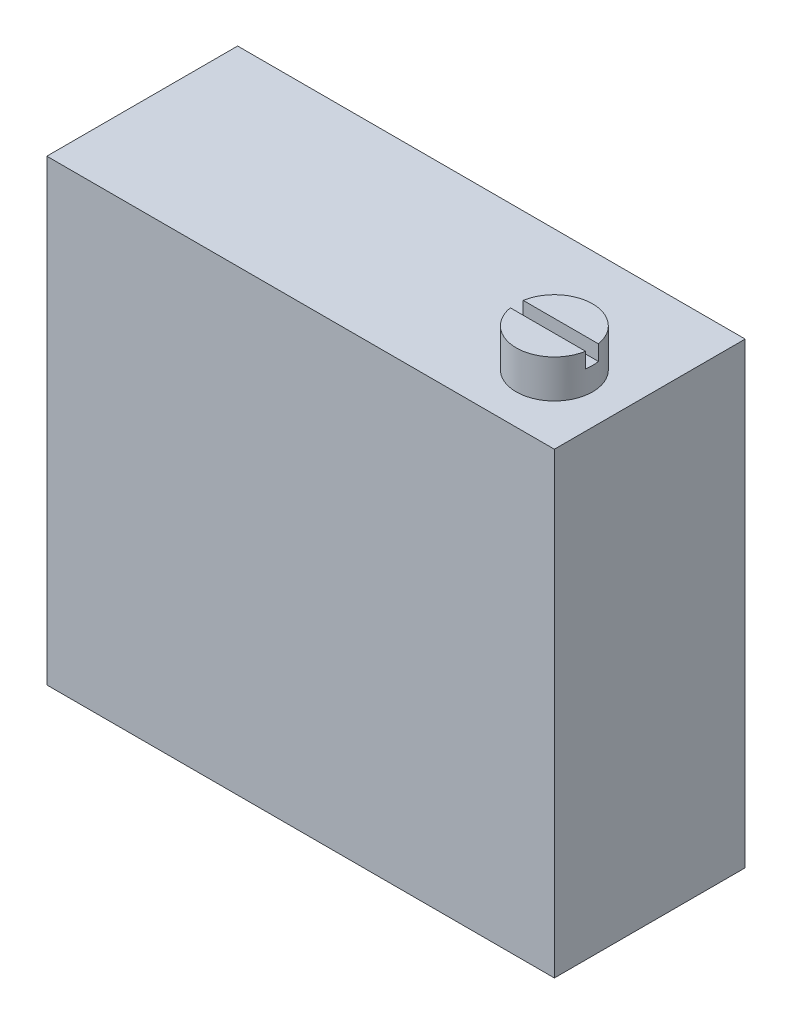
ISO-10303-21;
HEADER;
FILE_DESCRIPTION(('STEP AP214'),'2;1');
FILE_NAME('part.step','',(''),(''),'','','');
FILE_SCHEMA(('AUTOMOTIVE_DESIGN { 1 0 10303 214 1 1 1 1 }'));
ENDSEC;
DATA;
#1=APPLICATION_CONTEXT('core data for automotive mechanical design processes');
#2=APPLICATION_PROTOCOL_DEFINITION('international standard','automotive_design',2000,#1);
#3=PRODUCT_CONTEXT('',#1,'mechanical');
#4=PRODUCT('Part','Part','',(#3));
#5=PRODUCT_RELATED_PRODUCT_CATEGORY('part','',(#4));
#6=PRODUCT_DEFINITION_FORMATION('','',#4);
#7=PRODUCT_DEFINITION_CONTEXT('part definition',#1,'design');
#8=PRODUCT_DEFINITION('design','',#6,#7);
#9=PRODUCT_DEFINITION_SHAPE('','',#8);
#10=(LENGTH_UNIT() NAMED_UNIT(*) SI_UNIT(.MILLI.,.METRE.));
#11=(NAMED_UNIT(*) PLANE_ANGLE_UNIT() SI_UNIT($,.RADIAN.));
#12=(NAMED_UNIT(*) SI_UNIT($,.STERADIAN.) SOLID_ANGLE_UNIT());
#13=UNCERTAINTY_MEASURE_WITH_UNIT(LENGTH_MEASURE(1.E-05),#10,'distance_accuracy_value','');
#14=(GEOMETRIC_REPRESENTATION_CONTEXT(3) GLOBAL_UNCERTAINTY_ASSIGNED_CONTEXT((#13)) GLOBAL_UNIT_ASSIGNED_CONTEXT((#10,
#11,#12)) REPRESENTATION_CONTEXT('',''));
#15=CARTESIAN_POINT('',(0.,0.,0.));
#16=DIRECTION('',(0.,0.,1.));
#17=DIRECTION('',(1.,0.,0.));
#18=AXIS2_PLACEMENT_3D('',#15,#16,#17);
#19=CARTESIAN_POINT('',(-33.4993079584775,13.,19.2264623496457));
#20=DIRECTION('',(0.,1.,0.));
#21=DIRECTION('',(0.,0.,1.));
#22=AXIS2_PLACEMENT_3D('',#19,#20,#21);
#23=PLANE('',#22);
#24=DIRECTION('',(1.,0.,0.));
#25=VECTOR('',#24,1.);
#26=CARTESIAN_POINT('',(-33.4993079584775,13.,19.3951981505615));
#27=LINE('',#26,#25);
#28=CARTESIAN_POINT('',(-34.48496927429,13.,19.3951981505615));
#29=VERTEX_POINT('',#28);
#30=CARTESIAN_POINT('',(-32.513646642665,13.,19.3951981505615));
#31=VERTEX_POINT('',#30);
#32=EDGE_CURVE('E128',#29,#31,#27,.T.);
#33=ORIENTED_EDGE('',*,*,#32,.F.);
#34=CARTESIAN_POINT('',(-33.4993079584775,13.,19.2264623496457));
#35=DIRECTION('',(0.,1.,0.));
#36=DIRECTION('',(0.,0.,1.));
#37=AXIS2_PLACEMENT_3D('',#34,#35,#36);
#38=CIRCLE('',#37,0.999999999999998);
#39=EDGE_CURVE('E143',#29,#31,#38,.T.);
#40=ORIENTED_EDGE('',*,*,#39,.T.);
#41=EDGE_LOOP('',(#33,#40));
#42=FACE_BOUND('',#41,.T.);
#43=ADVANCED_FACE('F45',(#42),#23,.T.);
#44=CARTESIAN_POINT('',(-44.9993079584775,12.,16.0264623496457));
#45=DIRECTION('',(1.,0.,0.));
#46=DIRECTION('',(0.,0.,-1.));
#47=AXIS2_PLACEMENT_3D('',#44,#45,#46);
#48=PLANE('',#47);
#49=DIRECTION('',(0.,0.,1.));
#50=VECTOR('',#49,1.);
#51=CARTESIAN_POINT('',(-44.9993079584775,0.,16.0264623496457));
#52=LINE('',#51,#50);
#53=CARTESIAN_POINT('',(-44.9993079584775,0.,16.0264623496457));
#54=VERTEX_POINT('',#53);
#55=CARTESIAN_POINT('',(-44.9993079584775,0.,21.0264623496457));
#56=VERTEX_POINT('',#55);
#57=EDGE_CURVE('E142',#54,#56,#52,.T.);
#58=ORIENTED_EDGE('',*,*,#57,.T.);
#59=DIRECTION('',(0.,-1.,0.));
#60=VECTOR('',#59,1.);
#61=CARTESIAN_POINT('',(-44.9993079584775,12.,21.0264623496457));
#62=LINE('',#61,#60);
#63=CARTESIAN_POINT('',(-44.9993079584775,12.,21.0264623496457));
#64=VERTEX_POINT('',#63);
#65=EDGE_CURVE('E129',#64,#56,#62,.T.);
#66=ORIENTED_EDGE('',*,*,#65,.F.);
#67=DIRECTION('',(0.,0.,1.));
#68=VECTOR('',#67,1.);
#69=CARTESIAN_POINT('',(-44.9993079584775,12.,16.0264623496457));
#70=LINE('',#69,#68);
#71=CARTESIAN_POINT('',(-44.9993079584775,12.,16.0264623496457));
#72=VERTEX_POINT('',#71);
#73=EDGE_CURVE('E159',#72,#64,#70,.T.);
#74=ORIENTED_EDGE('',*,*,#73,.F.);
#75=DIRECTION('',(0.,-1.,0.));
#76=VECTOR('',#75,1.);
#77=CARTESIAN_POINT('',(-44.9993079584775,12.,16.0264623496457));
#78=LINE('',#77,#76);
#79=EDGE_CURVE('E168',#72,#54,#78,.T.);
#80=ORIENTED_EDGE('',*,*,#79,.T.);
#81=EDGE_LOOP('',(#58,#66,#74,#80));
#82=FACE_BOUND('',#81,.T.);
#83=ADVANCED_FACE('F47',(#82),#48,.F.);
#84=CARTESIAN_POINT('',(-44.9993079584775,12.,21.0264623496457));
#85=DIRECTION('',(0.,0.,-1.));
#86=DIRECTION('',(-1.,0.,0.));
#87=AXIS2_PLACEMENT_3D('',#84,#85,#86);
#88=PLANE('',#87);
#89=DIRECTION('',(1.,0.,0.));
#90=VECTOR('',#89,1.);
#91=CARTESIAN_POINT('',(-44.9993079584775,0.,21.0264623496457));
#92=LINE('',#91,#90);
#93=CARTESIAN_POINT('',(-31.6993079584775,0.,21.0264623496457));
#94=VERTEX_POINT('',#93);
#95=EDGE_CURVE('E148',#56,#94,#92,.T.);
#96=ORIENTED_EDGE('',*,*,#95,.T.);
#97=DIRECTION('',(0.,-1.,0.));
#98=VECTOR('',#97,1.);
#99=CARTESIAN_POINT('',(-31.6993079584775,12.,21.0264623496457));
#100=LINE('',#99,#98);
#101=CARTESIAN_POINT('',(-31.6993079584775,12.,21.0264623496457));
#102=VERTEX_POINT('',#101);
#103=EDGE_CURVE('E182',#102,#94,#100,.T.);
#104=ORIENTED_EDGE('',*,*,#103,.F.);
#105=DIRECTION('',(1.,0.,0.));
#106=VECTOR('',#105,1.);
#107=CARTESIAN_POINT('',(-44.9993079584775,12.,21.0264623496457));
#108=LINE('',#107,#106);
#109=EDGE_CURVE('E99',#64,#102,#108,.T.);
#110=ORIENTED_EDGE('',*,*,#109,.F.);
#111=ORIENTED_EDGE('',*,*,#65,.T.);
#112=EDGE_LOOP('',(#96,#104,#110,#111));
#113=FACE_BOUND('',#112,.T.);
#114=ADVANCED_FACE('F204',(#113),#88,.F.);
#115=CARTESIAN_POINT('',(-31.6993079584775,12.,16.0264623496457));
#116=DIRECTION('',(-1.,0.,0.));
#117=DIRECTION('',(0.,0.,1.));
#118=AXIS2_PLACEMENT_3D('',#115,#116,#117);
#119=PLANE('',#118);
#120=DIRECTION('',(0.,0.,-1.));
#121=VECTOR('',#120,1.);
#122=CARTESIAN_POINT('',(-31.6993079584775,0.,16.0264623496457));
#123=LINE('',#122,#121);
#124=CARTESIAN_POINT('',(-31.6993079584775,0.,16.0264623496457));
#125=VERTEX_POINT('',#124);
#126=EDGE_CURVE('E172',#94,#125,#123,.T.);
#127=ORIENTED_EDGE('',*,*,#126,.T.);
#128=DIRECTION('',(0.,-1.,0.));
#129=VECTOR('',#128,1.);
#130=CARTESIAN_POINT('',(-31.6993079584775,12.,16.0264623496457));
#131=LINE('',#130,#129);
#132=CARTESIAN_POINT('',(-31.6993079584775,12.,16.0264623496457));
#133=VERTEX_POINT('',#132);
#134=EDGE_CURVE('E179',#133,#125,#131,.T.);
#135=ORIENTED_EDGE('',*,*,#134,.F.);
#136=DIRECTION('',(0.,0.,-1.));
#137=VECTOR('',#136,1.);
#138=CARTESIAN_POINT('',(-31.6993079584775,12.,16.0264623496457));
#139=LINE('',#138,#137);
#140=EDGE_CURVE('E164',#102,#133,#139,.T.);
#141=ORIENTED_EDGE('',*,*,#140,.F.);
#142=ORIENTED_EDGE('',*,*,#103,.T.);
#143=EDGE_LOOP('',(#127,#135,#141,#142));
#144=FACE_BOUND('',#143,.T.);
#145=ADVANCED_FACE('F230',(#144),#119,.F.);
#146=CARTESIAN_POINT('',(-44.9993079584775,12.,16.0264623496457));
#147=DIRECTION('',(0.,0.,1.));
#148=DIRECTION('',(1.,0.,0.));
#149=AXIS2_PLACEMENT_3D('',#146,#147,#148);
#150=PLANE('',#149);
#151=DIRECTION('',(-1.,0.,0.));
#152=VECTOR('',#151,1.);
#153=CARTESIAN_POINT('',(-44.9993079584775,0.,16.0264623496457));
#154=LINE('',#153,#152);
#155=EDGE_CURVE('E91',#125,#54,#154,.T.);
#156=ORIENTED_EDGE('',*,*,#155,.T.);
#157=ORIENTED_EDGE('',*,*,#79,.F.);
#158=DIRECTION('',(-1.,0.,0.));
#159=VECTOR('',#158,1.);
#160=CARTESIAN_POINT('',(-44.9993079584775,12.,16.0264623496457));
#161=LINE('',#160,#159);
#162=EDGE_CURVE('E70',#133,#72,#161,.T.);
#163=ORIENTED_EDGE('',*,*,#162,.F.);
#164=ORIENTED_EDGE('',*,*,#134,.T.);
#165=EDGE_LOOP('',(#156,#157,#163,#164));
#166=FACE_BOUND('',#165,.T.);
#167=ADVANCED_FACE('F225',(#166),#150,.F.);
#168=CARTESIAN_POINT('',(0.,12.,0.));
#169=DIRECTION('',(0.,1.,0.));
#170=DIRECTION('',(0.,0.,1.));
#171=AXIS2_PLACEMENT_3D('',#168,#169,#170);
#172=PLANE('',#171);
#173=CARTESIAN_POINT('',(-33.4993079584775,12.,19.2264623496457));
#174=DIRECTION('',(0.,1.,0.));
#175=DIRECTION('',(0.,0.,1.));
#176=AXIS2_PLACEMENT_3D('',#173,#174,#175);
#177=CIRCLE('',#176,0.999999999999998);
#178=CARTESIAN_POINT('',(-33.4993079584775,12.,20.2264623496457));
#179=VERTEX_POINT('',#178);
#180=EDGE_CURVE('E151',#179,#179,#177,.T.);
#181=ORIENTED_EDGE('',*,*,#180,.F.);
#182=EDGE_LOOP('',(#181));
#183=FACE_BOUND('',#182,.T.);
#184=ORIENTED_EDGE('',*,*,#73,.T.);
#185=ORIENTED_EDGE('',*,*,#109,.T.);
#186=ORIENTED_EDGE('',*,*,#140,.T.);
#187=ORIENTED_EDGE('',*,*,#162,.T.);
#188=EDGE_LOOP('',(#184,#185,#186,#187));
#189=FACE_BOUND('',#188,.T.);
#190=ADVANCED_FACE('F220',(#183,#189),#172,.T.);
#191=CARTESIAN_POINT('',(0.,0.,0.));
#192=DIRECTION('',(0.,1.,0.));
#193=DIRECTION('',(0.,0.,1.));
#194=AXIS2_PLACEMENT_3D('',#191,#192,#193);
#195=PLANE('',#194);
#196=ORIENTED_EDGE('',*,*,#57,.F.);
#197=ORIENTED_EDGE('',*,*,#155,.F.);
#198=ORIENTED_EDGE('',*,*,#126,.F.);
#199=ORIENTED_EDGE('',*,*,#95,.F.);
#200=EDGE_LOOP('',(#196,#197,#198,#199));
#201=FACE_BOUND('',#200,.T.);
#202=ADVANCED_FACE('F216',(#201),#195,.F.);
#203=CARTESIAN_POINT('',(-33.4993079584775,13.,19.2264623496457));
#204=DIRECTION('',(0.,-1.,0.));
#205=DIRECTION('',(0.,0.,-1.));
#206=AXIS2_PLACEMENT_3D('',#203,#204,#205);
#207=CYLINDRICAL_SURFACE('',#206,0.999999999999998);
#208=CARTESIAN_POINT('',(-33.4993079584775,12.6,19.2264623496457));
#209=DIRECTION('',(0.,-1.,0.));
#210=DIRECTION('',(0.,0.,-1.));
#211=AXIS2_PLACEMENT_3D('',#208,#209,#210);
#212=CIRCLE('',#211,0.999999999999998);
#213=CARTESIAN_POINT('',(-32.513646642665,12.6,19.05772654873));
#214=VERTEX_POINT('',#213);
#215=CARTESIAN_POINT('',(-32.513646642665,12.6,19.3951981505615));
#216=VERTEX_POINT('',#215);
#217=EDGE_CURVE('E11',#214,#216,#212,.T.);
#218=ORIENTED_EDGE('',*,*,#217,.T.);
#219=DIRECTION('',(0.,-1.,0.));
#220=VECTOR('',#219,1.);
#221=CARTESIAN_POINT('',(-32.513646642665,13.,19.3951981505615));
#222=LINE('',#221,#220);
#223=EDGE_CURVE('E194',#216,#31,#222,.F.);
#224=ORIENTED_EDGE('',*,*,#223,.T.);
#225=ORIENTED_EDGE('',*,*,#39,.F.);
#226=DIRECTION('',(0.,-1.,0.));
#227=VECTOR('',#226,1.);
#228=CARTESIAN_POINT('',(-34.48496927429,13.,19.3951981505615));
#229=LINE('',#228,#227);
#230=CARTESIAN_POINT('',(-34.48496927429,12.6,19.3951981505615));
#231=VERTEX_POINT('',#230);
#232=EDGE_CURVE('E154',#29,#231,#229,.T.);
#233=ORIENTED_EDGE('',*,*,#232,.T.);
#234=CARTESIAN_POINT('',(-34.48496927429,12.6,19.05772654873));
#235=VERTEX_POINT('',#234);
#236=EDGE_CURVE('E49',#231,#235,#212,.T.);
#237=ORIENTED_EDGE('',*,*,#236,.T.);
#238=DIRECTION('',(0.,-1.,0.));
#239=VECTOR('',#238,1.);
#240=CARTESIAN_POINT('',(-34.48496927429,13.,19.05772654873));
#241=LINE('',#240,#239);
#242=CARTESIAN_POINT('',(-34.48496927429,13.,19.05772654873));
#243=VERTEX_POINT('',#242);
#244=EDGE_CURVE('E122',#235,#243,#241,.F.);
#245=ORIENTED_EDGE('',*,*,#244,.T.);
#246=CARTESIAN_POINT('',(-32.513646642665,13.,19.05772654873));
#247=VERTEX_POINT('',#246);
#248=EDGE_CURVE('E135',#247,#243,#38,.T.);
#249=ORIENTED_EDGE('',*,*,#248,.F.);
#250=DIRECTION('',(0.,-1.,0.));
#251=VECTOR('',#250,1.);
#252=CARTESIAN_POINT('',(-32.513646642665,13.,19.05772654873));
#253=LINE('',#252,#251);
#254=EDGE_CURVE('E61',#247,#214,#253,.T.);
#255=ORIENTED_EDGE('',*,*,#254,.T.);
#256=EDGE_LOOP('',(#218,#224,#225,#233,#237,#245,#249,#255));
#257=FACE_BOUND('',#256,.T.);
#258=ORIENTED_EDGE('',*,*,#180,.T.);
#259=EDGE_LOOP('',(#258));
#260=FACE_BOUND('',#259,.T.);
#261=ADVANCED_FACE('F133',(#257,#260),#207,.T.);
#262=DIRECTION('',(-1.,0.,0.));
#263=VECTOR('',#262,1.);
#264=CARTESIAN_POINT('',(-33.4993079584775,13.,19.05772654873));
#265=LINE('',#264,#263);
#266=EDGE_CURVE('E119',#247,#243,#265,.T.);
#267=ORIENTED_EDGE('',*,*,#266,.F.);
#268=ORIENTED_EDGE('',*,*,#248,.T.);
#269=EDGE_LOOP('',(#267,#268));
#270=FACE_BOUND('',#269,.T.);
#271=ADVANCED_FACE('F140',(#270),#23,.T.);
#272=CARTESIAN_POINT('',(0.,12.6,0.));
#273=DIRECTION('',(0.,-1.,0.));
#274=DIRECTION('',(0.,0.,-1.));
#275=AXIS2_PLACEMENT_3D('',#272,#273,#274);
#276=PLANE('',#275);
#277=DIRECTION('',(-1.,0.,0.));
#278=VECTOR('',#277,1.);
#279=CARTESIAN_POINT('',(-34.8686408490907,12.6,19.05772654873));
#280=LINE('',#279,#278);
#281=EDGE_CURVE('E346',#214,#235,#280,.T.);
#282=ORIENTED_EDGE('',*,*,#281,.T.);
#283=ORIENTED_EDGE('',*,*,#236,.F.);
#284=DIRECTION('',(1.,0.,0.));
#285=VECTOR('',#284,1.);
#286=CARTESIAN_POINT('',(-34.8686408490907,12.6,19.3951981505615));
#287=LINE('',#286,#285);
#288=EDGE_CURVE('E138',#231,#216,#287,.T.);
#289=ORIENTED_EDGE('',*,*,#288,.T.);
#290=ORIENTED_EDGE('',*,*,#217,.F.);
#291=EDGE_LOOP('',(#282,#283,#289,#290));
#292=FACE_BOUND('',#291,.T.);
#293=ADVANCED_FACE('F209',(#292),#276,.F.);
#294=CARTESIAN_POINT('',(-34.8686408490907,12.6,19.3951981505615));
#295=DIRECTION('',(0.,0.,1.));
#296=DIRECTION('',(1.,0.,0.));
#297=AXIS2_PLACEMENT_3D('',#294,#295,#296);
#298=PLANE('',#297);
#299=ORIENTED_EDGE('',*,*,#32,.T.);
#300=ORIENTED_EDGE('',*,*,#223,.F.);
#301=ORIENTED_EDGE('',*,*,#288,.F.);
#302=ORIENTED_EDGE('',*,*,#232,.F.);
#303=EDGE_LOOP('',(#299,#300,#301,#302));
#304=FACE_BOUND('',#303,.T.);
#305=ADVANCED_FACE('F192',(#304),#298,.F.);
#306=CARTESIAN_POINT('',(-34.8686408490907,12.6,19.05772654873));
#307=DIRECTION('',(0.,0.,-1.));
#308=DIRECTION('',(-1.,0.,0.));
#309=AXIS2_PLACEMENT_3D('',#306,#307,#308);
#310=PLANE('',#309);
#311=ORIENTED_EDGE('',*,*,#266,.T.);
#312=ORIENTED_EDGE('',*,*,#244,.F.);
#313=ORIENTED_EDGE('',*,*,#281,.F.);
#314=ORIENTED_EDGE('',*,*,#254,.F.);
#315=EDGE_LOOP('',(#311,#312,#313,#314));
#316=FACE_BOUND('',#315,.T.);
#317=ADVANCED_FACE('F121',(#316),#310,.F.);
#318=CLOSED_SHELL('',(#43,#83,#114,#145,#167,#190,#202,#261,#271,#293,#305,#317));
#319=MANIFOLD_SOLID_BREP('B2',#318);
#320=ADVANCED_BREP_SHAPE_REPRESENTATION('',(#18,#319),#14);
#321=SHAPE_DEFINITION_REPRESENTATION(#9,#320);
ENDSEC;
END-ISO-10303-21;
